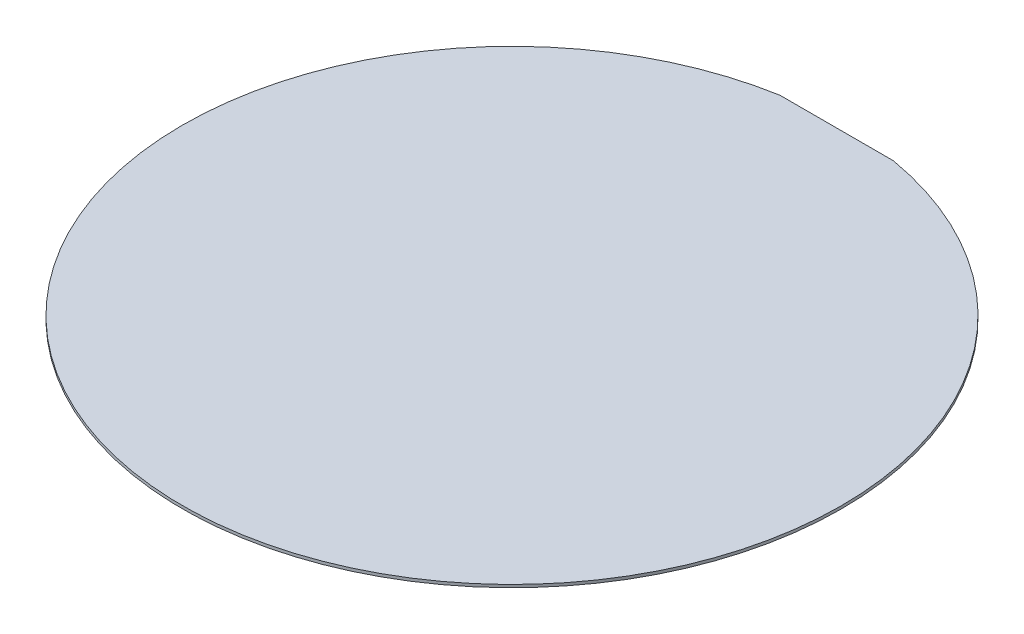
ISO-10303-21;
HEADER;
FILE_DESCRIPTION(('STEP AP214'),'2;1');
FILE_NAME('part.step','',(''),(''),'','','');
FILE_SCHEMA(('AUTOMOTIVE_DESIGN { 1 0 10303 214 1 1 1 1 }'));
ENDSEC;
DATA;
#1=APPLICATION_CONTEXT('core data for automotive mechanical design processes');
#2=APPLICATION_PROTOCOL_DEFINITION('international standard','automotive_design',2000,#1);
#3=PRODUCT_CONTEXT('',#1,'mechanical');
#4=PRODUCT('Part','Part','',(#3));
#5=PRODUCT_RELATED_PRODUCT_CATEGORY('part','',(#4));
#6=PRODUCT_DEFINITION_FORMATION('','',#4);
#7=PRODUCT_DEFINITION_CONTEXT('part definition',#1,'design');
#8=PRODUCT_DEFINITION('design','',#6,#7);
#9=PRODUCT_DEFINITION_SHAPE('','',#8);
#10=(LENGTH_UNIT() NAMED_UNIT(*) SI_UNIT(.MILLI.,.METRE.));
#11=(NAMED_UNIT(*) PLANE_ANGLE_UNIT() SI_UNIT($,.RADIAN.));
#12=(NAMED_UNIT(*) SI_UNIT($,.STERADIAN.) SOLID_ANGLE_UNIT());
#13=UNCERTAINTY_MEASURE_WITH_UNIT(LENGTH_MEASURE(1.E-05),#10,'distance_accuracy_value','');
#14=(GEOMETRIC_REPRESENTATION_CONTEXT(3) GLOBAL_UNCERTAINTY_ASSIGNED_CONTEXT((#13)) GLOBAL_UNIT_ASSIGNED_CONTEXT((#10,
#11,#12)) REPRESENTATION_CONTEXT('',''));
#15=CARTESIAN_POINT('',(0.,0.,0.));
#16=DIRECTION('',(0.,0.,1.));
#17=DIRECTION('',(1.,0.,0.));
#18=AXIS2_PLACEMENT_3D('',#15,#16,#17);
#19=CARTESIAN_POINT('',(0.,1.5,0.));
#20=DIRECTION('',(0.,-1.,0.));
#21=DIRECTION('',(0.,0.,-1.));
#22=AXIS2_PLACEMENT_3D('',#19,#20,#21);
#23=CYLINDRICAL_SURFACE('',#22,175.);
#24=CARTESIAN_POINT('',(0.,0.,0.));
#25=DIRECTION('',(0.,1.,0.));
#26=DIRECTION('',(0.,0.,1.));
#27=AXIS2_PLACEMENT_3D('',#24,#25,#26);
#28=CIRCLE('',#27,175.);
#29=CARTESIAN_POINT('',(-30.1303837507559,0.,-172.386658344061));
#30=VERTEX_POINT('',#29);
#31=CARTESIAN_POINT('',(30.1303837507559,0.,-172.386658344061));
#32=VERTEX_POINT('',#31);
#33=EDGE_CURVE('E64',#30,#32,#28,.T.);
#34=ORIENTED_EDGE('',*,*,#33,.T.);
#35=DIRECTION('',(0.,-1.,0.));
#36=VECTOR('',#35,1.);
#37=CARTESIAN_POINT('',(30.1303837507559,1.5,-172.386658344061));
#38=LINE('',#37,#36);
#39=CARTESIAN_POINT('',(30.1303837507559,1.5,-172.386658344061));
#40=VERTEX_POINT('',#39);
#41=EDGE_CURVE('E11',#40,#32,#38,.T.);
#42=ORIENTED_EDGE('',*,*,#41,.F.);
#43=CARTESIAN_POINT('',(0.,1.5,0.));
#44=DIRECTION('',(0.,1.,0.));
#45=DIRECTION('',(0.,0.,1.));
#46=AXIS2_PLACEMENT_3D('',#43,#44,#45);
#47=CIRCLE('',#46,175.);
#48=CARTESIAN_POINT('',(-30.1303837507559,1.5,-172.386658344061));
#49=VERTEX_POINT('',#48);
#50=EDGE_CURVE('E63',#49,#40,#47,.T.);
#51=ORIENTED_EDGE('',*,*,#50,.F.);
#52=DIRECTION('',(0.,-1.,0.));
#53=VECTOR('',#52,1.);
#54=CARTESIAN_POINT('',(-30.1303837507559,1.5,-172.386658344061));
#55=LINE('',#54,#53);
#56=EDGE_CURVE('E41',#49,#30,#55,.T.);
#57=ORIENTED_EDGE('',*,*,#56,.T.);
#58=EDGE_LOOP('',(#34,#42,#51,#57));
#59=FACE_BOUND('',#58,.T.);
#60=ADVANCED_FACE('F33',(#59),#23,.T.);
#61=CARTESIAN_POINT('',(-30.1303837507559,1.5,-172.386658344061));
#62=DIRECTION('',(0.,0.,1.));
#63=DIRECTION('',(1.,0.,0.));
#64=AXIS2_PLACEMENT_3D('',#61,#62,#63);
#65=PLANE('',#64);
#66=DIRECTION('',(-1.,0.,0.));
#67=VECTOR('',#66,1.);
#68=CARTESIAN_POINT('',(-30.1303837507559,0.,-172.386658344061));
#69=LINE('',#68,#67);
#70=EDGE_CURVE('E56',#32,#30,#69,.T.);
#71=ORIENTED_EDGE('',*,*,#70,.T.);
#72=ORIENTED_EDGE('',*,*,#56,.F.);
#73=DIRECTION('',(-1.,0.,0.));
#74=VECTOR('',#73,1.);
#75=CARTESIAN_POINT('',(-30.1303837507559,1.5,-172.386658344061));
#76=LINE('',#75,#74);
#77=EDGE_CURVE('E48',#40,#49,#76,.T.);
#78=ORIENTED_EDGE('',*,*,#77,.F.);
#79=ORIENTED_EDGE('',*,*,#41,.T.);
#80=EDGE_LOOP('',(#71,#72,#78,#79));
#81=FACE_BOUND('',#80,.T.);
#82=ADVANCED_FACE('F59',(#81),#65,.F.);
#83=CARTESIAN_POINT('',(0.,1.5,0.));
#84=DIRECTION('',(0.,1.,0.));
#85=DIRECTION('',(0.,0.,1.));
#86=AXIS2_PLACEMENT_3D('',#83,#84,#85);
#87=PLANE('',#86);
#88=ORIENTED_EDGE('',*,*,#50,.T.);
#89=ORIENTED_EDGE('',*,*,#77,.T.);
#90=EDGE_LOOP('',(#88,#89));
#91=FACE_BOUND('',#90,.T.);
#92=ADVANCED_FACE('F71',(#91),#87,.T.);
#93=CARTESIAN_POINT('',(0.,0.,0.));
#94=DIRECTION('',(0.,1.,0.));
#95=DIRECTION('',(0.,0.,1.));
#96=AXIS2_PLACEMENT_3D('',#93,#94,#95);
#97=PLANE('',#96);
#98=ORIENTED_EDGE('',*,*,#33,.F.);
#99=ORIENTED_EDGE('',*,*,#70,.F.);
#100=EDGE_LOOP('',(#98,#99));
#101=FACE_BOUND('',#100,.T.);
#102=ADVANCED_FACE('F67',(#101),#97,.F.);
#103=CLOSED_SHELL('',(#60,#82,#92,#102));
#104=MANIFOLD_SOLID_BREP('B2',#103);
#105=ADVANCED_BREP_SHAPE_REPRESENTATION('',(#18,#104),#14);
#106=SHAPE_DEFINITION_REPRESENTATION(#9,#105);
ENDSEC;
END-ISO-10303-21;
